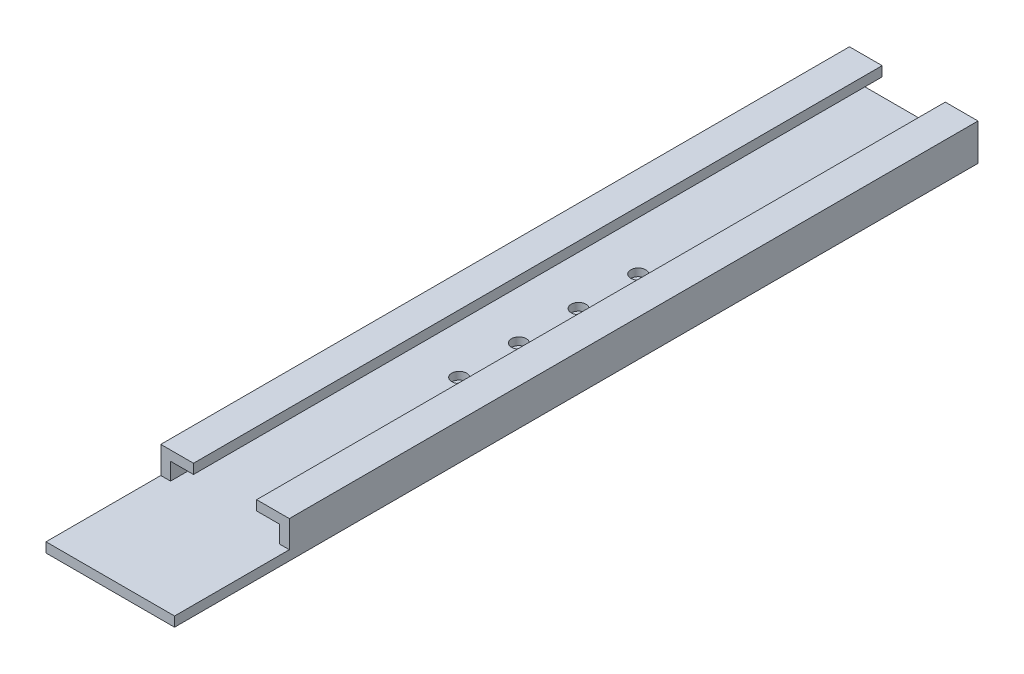
ISO-10303-21;
HEADER;
FILE_DESCRIPTION(('STEP AP214'),'2;1');
FILE_NAME('part.step','',(''),(''),'','','');
FILE_SCHEMA(('AUTOMOTIVE_DESIGN { 1 0 10303 214 1 1 1 1 }'));
ENDSEC;
DATA;
#1=APPLICATION_CONTEXT('core data for automotive mechanical design processes');
#2=APPLICATION_PROTOCOL_DEFINITION('international standard','automotive_design',2000,#1);
#3=PRODUCT_CONTEXT('',#1,'mechanical');
#4=PRODUCT('Part','Part','',(#3));
#5=PRODUCT_RELATED_PRODUCT_CATEGORY('part','',(#4));
#6=PRODUCT_DEFINITION_FORMATION('','',#4);
#7=PRODUCT_DEFINITION_CONTEXT('part definition',#1,'design');
#8=PRODUCT_DEFINITION('design','',#6,#7);
#9=PRODUCT_DEFINITION_SHAPE('','',#8);
#10=(LENGTH_UNIT() NAMED_UNIT(*) SI_UNIT(.MILLI.,.METRE.));
#11=(NAMED_UNIT(*) PLANE_ANGLE_UNIT() SI_UNIT($,.RADIAN.));
#12=(NAMED_UNIT(*) SI_UNIT($,.STERADIAN.) SOLID_ANGLE_UNIT());
#13=UNCERTAINTY_MEASURE_WITH_UNIT(LENGTH_MEASURE(1.E-05),#10,'distance_accuracy_value','');
#14=(GEOMETRIC_REPRESENTATION_CONTEXT(3) GLOBAL_UNCERTAINTY_ASSIGNED_CONTEXT((#13)) GLOBAL_UNIT_ASSIGNED_CONTEXT((#10,
#11,#12)) REPRESENTATION_CONTEXT('',''));
#15=CARTESIAN_POINT('',(0.,0.,0.));
#16=DIRECTION('',(0.,0.,1.));
#17=DIRECTION('',(1.,0.,0.));
#18=AXIS2_PLACEMENT_3D('',#15,#16,#17);
#19=CARTESIAN_POINT('',(47.5,-8.5,396.));
#20=DIRECTION('',(0.,1.,0.));
#21=DIRECTION('',(0.,0.,1.));
#22=AXIS2_PLACEMENT_3D('',#19,#20,#21);
#23=CYLINDRICAL_SURFACE('',#22,3.30000000000006);
#24=CARTESIAN_POINT('',(47.5,-8.5,396.));
#25=DIRECTION('',(0.,1.,0.));
#26=DIRECTION('',(0.,0.,1.));
#27=AXIS2_PLACEMENT_3D('',#24,#25,#26);
#28=CIRCLE('',#27,3.30000000000006);
#29=CARTESIAN_POINT('',(47.5,-8.5,399.3));
#30=VERTEX_POINT('',#29);
#31=EDGE_CURVE('E222',#30,#30,#28,.T.);
#32=ORIENTED_EDGE('',*,*,#31,.F.);
#33=EDGE_LOOP('',(#32));
#34=FACE_BOUND('',#33,.T.);
#35=CARTESIAN_POINT('',(47.5,-6.6,396.));
#36=DIRECTION('',(0.,1.,0.));
#37=DIRECTION('',(0.,0.,1.));
#38=AXIS2_PLACEMENT_3D('',#35,#36,#37);
#39=CIRCLE('',#38,3.30000000000006);
#40=CARTESIAN_POINT('',(47.5,-6.6,399.3));
#41=VERTEX_POINT('',#40);
#42=EDGE_CURVE('E39',#41,#41,#39,.F.);
#43=ORIENTED_EDGE('',*,*,#42,.F.);
#44=EDGE_LOOP('',(#43));
#45=FACE_BOUND('',#44,.T.);
#46=ADVANCED_FACE('F35',(#34,#45),#23,.F.);
#47=CARTESIAN_POINT('',(47.5,-8.5,344.));
#48=DIRECTION('',(0.,1.,0.));
#49=DIRECTION('',(0.,0.,1.));
#50=AXIS2_PLACEMENT_3D('',#47,#48,#49);
#51=CYLINDRICAL_SURFACE('',#50,3.30000000000005);
#52=CARTESIAN_POINT('',(47.5,-8.5,344.));
#53=DIRECTION('',(0.,1.,0.));
#54=DIRECTION('',(0.,0.,1.));
#55=AXIS2_PLACEMENT_3D('',#52,#53,#54);
#56=CIRCLE('',#55,3.30000000000005);
#57=CARTESIAN_POINT('',(47.5,-8.5,347.3));
#58=VERTEX_POINT('',#57);
#59=EDGE_CURVE('E226',#58,#58,#56,.T.);
#60=ORIENTED_EDGE('',*,*,#59,.F.);
#61=EDGE_LOOP('',(#60));
#62=FACE_BOUND('',#61,.T.);
#63=CARTESIAN_POINT('',(47.5,-6.6,344.));
#64=DIRECTION('',(0.,1.,0.));
#65=DIRECTION('',(0.,0.,1.));
#66=AXIS2_PLACEMENT_3D('',#63,#64,#65);
#67=CIRCLE('',#66,3.30000000000005);
#68=CARTESIAN_POINT('',(47.5,-6.6,347.3));
#69=VERTEX_POINT('',#68);
#70=EDGE_CURVE('E217',#69,#69,#67,.F.);
#71=ORIENTED_EDGE('',*,*,#70,.F.);
#72=EDGE_LOOP('',(#71));
#73=FACE_BOUND('',#72,.T.);
#74=ADVANCED_FACE('F326',(#62,#73),#51,.F.);
#75=CARTESIAN_POINT('',(47.5,-8.5,292.));
#76=DIRECTION('',(0.,1.,0.));
#77=DIRECTION('',(0.,0.,1.));
#78=AXIS2_PLACEMENT_3D('',#75,#76,#77);
#79=CYLINDRICAL_SURFACE('',#78,3.30000000000004);
#80=CARTESIAN_POINT('',(47.5,-8.5,292.));
#81=DIRECTION('',(0.,1.,0.));
#82=DIRECTION('',(0.,0.,1.));
#83=AXIS2_PLACEMENT_3D('',#80,#81,#82);
#84=CIRCLE('',#83,3.30000000000004);
#85=CARTESIAN_POINT('',(47.5,-8.5,295.3));
#86=VERTEX_POINT('',#85);
#87=EDGE_CURVE('E231',#86,#86,#84,.T.);
#88=ORIENTED_EDGE('',*,*,#87,.F.);
#89=EDGE_LOOP('',(#88));
#90=FACE_BOUND('',#89,.T.);
#91=CARTESIAN_POINT('',(47.5,-6.6,292.));
#92=DIRECTION('',(0.,1.,0.));
#93=DIRECTION('',(0.,0.,1.));
#94=AXIS2_PLACEMENT_3D('',#91,#92,#93);
#95=CIRCLE('',#94,3.30000000000004);
#96=CARTESIAN_POINT('',(47.5,-6.6,295.3));
#97=VERTEX_POINT('',#96);
#98=EDGE_CURVE('E214',#97,#97,#95,.F.);
#99=ORIENTED_EDGE('',*,*,#98,.F.);
#100=EDGE_LOOP('',(#99));
#101=FACE_BOUND('',#100,.T.);
#102=ADVANCED_FACE('F332',(#90,#101),#79,.F.);
#103=CARTESIAN_POINT('',(47.5,-8.5,240.));
#104=DIRECTION('',(0.,1.,0.));
#105=DIRECTION('',(0.,0.,1.));
#106=AXIS2_PLACEMENT_3D('',#103,#104,#105);
#107=CYLINDRICAL_SURFACE('',#106,3.30000000000002);
#108=CARTESIAN_POINT('',(47.5,-8.5,240.));
#109=DIRECTION('',(0.,1.,0.));
#110=DIRECTION('',(0.,0.,1.));
#111=AXIS2_PLACEMENT_3D('',#108,#109,#110);
#112=CIRCLE('',#111,3.30000000000002);
#113=CARTESIAN_POINT('',(47.5,-8.5,243.3));
#114=VERTEX_POINT('',#113);
#115=EDGE_CURVE('E247',#114,#114,#112,.T.);
#116=ORIENTED_EDGE('',*,*,#115,.F.);
#117=EDGE_LOOP('',(#116));
#118=FACE_BOUND('',#117,.T.);
#119=CARTESIAN_POINT('',(47.5,-6.6,240.));
#120=DIRECTION('',(0.,1.,0.));
#121=DIRECTION('',(0.,0.,1.));
#122=AXIS2_PLACEMENT_3D('',#119,#120,#121);
#123=CIRCLE('',#122,3.30000000000002);
#124=CARTESIAN_POINT('',(47.5,-6.6,243.3));
#125=VERTEX_POINT('',#124);
#126=EDGE_CURVE('E211',#125,#125,#123,.F.);
#127=ORIENTED_EDGE('',*,*,#126,.F.);
#128=EDGE_LOOP('',(#127));
#129=FACE_BOUND('',#128,.T.);
#130=ADVANCED_FACE('F323',(#118,#129),#107,.F.);
#131=CARTESIAN_POINT('',(0.,0.,600.));
#132=DIRECTION('',(0.,0.,-1.));
#133=DIRECTION('',(-1.,0.,0.));
#134=AXIS2_PLACEMENT_3D('',#131,#132,#133);
#135=PLANE('',#134);
#136=DIRECTION('',(0.,-1.,0.));
#137=VECTOR('',#136,1.);
#138=CARTESIAN_POINT('',(-8.5,-8.5,600.));
#139=LINE('',#138,#137);
#140=CARTESIAN_POINT('',(-8.5,23.5,600.));
#141=VERTEX_POINT('',#140);
#142=CARTESIAN_POINT('',(-8.5,0.,600.));
#143=VERTEX_POINT('',#142);
#144=EDGE_CURVE('E258',#141,#143,#139,.T.);
#145=ORIENTED_EDGE('',*,*,#144,.T.);
#146=DIRECTION('',(1.,0.,0.));
#147=VECTOR('',#146,1.);
#148=CARTESIAN_POINT('',(-8.5,0.,600.));
#149=LINE('',#148,#147);
#150=CARTESIAN_POINT('',(0.,0.,600.));
#151=VERTEX_POINT('',#150);
#152=EDGE_CURVE('E46',#143,#151,#149,.T.);
#153=ORIENTED_EDGE('',*,*,#152,.T.);
#154=DIRECTION('',(0.,1.,0.));
#155=VECTOR('',#154,1.);
#156=CARTESIAN_POINT('',(0.,0.,600.));
#157=LINE('',#156,#155);
#158=CARTESIAN_POINT('',(0.,15.,600.));
#159=VERTEX_POINT('',#158);
#160=EDGE_CURVE('E186',#151,#159,#157,.T.);
#161=ORIENTED_EDGE('',*,*,#160,.T.);
#162=DIRECTION('',(1.,0.,0.));
#163=VECTOR('',#162,1.);
#164=CARTESIAN_POINT('',(0.,15.,600.));
#165=LINE('',#164,#163);
#166=CARTESIAN_POINT('',(20.,15.,600.));
#167=VERTEX_POINT('',#166);
#168=EDGE_CURVE('E115',#159,#167,#165,.T.);
#169=ORIENTED_EDGE('',*,*,#168,.T.);
#170=DIRECTION('',(0.,1.,0.));
#171=VECTOR('',#170,1.);
#172=CARTESIAN_POINT('',(20.,15.,600.));
#173=LINE('',#172,#171);
#174=CARTESIAN_POINT('',(20.,23.5,600.));
#175=VERTEX_POINT('',#174);
#176=EDGE_CURVE('E254',#167,#175,#173,.T.);
#177=ORIENTED_EDGE('',*,*,#176,.T.);
#178=DIRECTION('',(-1.,0.,0.));
#179=VECTOR('',#178,1.);
#180=CARTESIAN_POINT('',(-8.5,23.5,600.));
#181=LINE('',#180,#179);
#182=EDGE_CURVE('E256',#175,#141,#181,.T.);
#183=ORIENTED_EDGE('',*,*,#182,.T.);
#184=EDGE_LOOP('',(#145,#153,#161,#169,#177,#183));
#185=FACE_BOUND('',#184,.T.);
#186=ADVANCED_FACE('F263',(#185),#135,.F.);
#187=CARTESIAN_POINT('',(0.,0.,600.));
#188=DIRECTION('',(-1.,0.,0.));
#189=DIRECTION('',(0.,0.,1.));
#190=AXIS2_PLACEMENT_3D('',#187,#188,#189);
#191=PLANE('',#190);
#192=DIRECTION('',(0.,1.,0.));
#193=VECTOR('',#192,1.);
#194=CARTESIAN_POINT('',(0.,0.,0.));
#195=LINE('',#194,#193);
#196=CARTESIAN_POINT('',(0.,0.,0.));
#197=VERTEX_POINT('',#196);
#198=CARTESIAN_POINT('',(0.,15.,0.));
#199=VERTEX_POINT('',#198);
#200=EDGE_CURVE('E162',#197,#199,#195,.T.);
#201=ORIENTED_EDGE('',*,*,#200,.T.);
#202=DIRECTION('',(0.,0.,-1.));
#203=VECTOR('',#202,1.);
#204=CARTESIAN_POINT('',(0.,15.,600.));
#205=LINE('',#204,#203);
#206=EDGE_CURVE('E44',#159,#199,#205,.T.);
#207=ORIENTED_EDGE('',*,*,#206,.F.);
#208=ORIENTED_EDGE('',*,*,#160,.F.);
#209=DIRECTION('',(0.,0.,-1.));
#210=VECTOR('',#209,1.);
#211=CARTESIAN_POINT('',(0.,0.,600.));
#212=LINE('',#211,#210);
#213=EDGE_CURVE('E161',#151,#197,#212,.T.);
#214=ORIENTED_EDGE('',*,*,#213,.T.);
#215=EDGE_LOOP('',(#201,#207,#208,#214));
#216=FACE_BOUND('',#215,.T.);
#217=ADVANCED_FACE('F37',(#216),#191,.F.);
#218=CARTESIAN_POINT('',(0.,15.,600.));
#219=DIRECTION('',(0.,1.,0.));
#220=DIRECTION('',(0.,0.,1.));
#221=AXIS2_PLACEMENT_3D('',#218,#219,#220);
#222=PLANE('',#221);
#223=DIRECTION('',(1.,0.,0.));
#224=VECTOR('',#223,1.);
#225=CARTESIAN_POINT('',(0.,15.,0.));
#226=LINE('',#225,#224);
#227=CARTESIAN_POINT('',(20.,15.,0.));
#228=VERTEX_POINT('',#227);
#229=EDGE_CURVE('E165',#199,#228,#226,.T.);
#230=ORIENTED_EDGE('',*,*,#229,.T.);
#231=DIRECTION('',(0.,0.,-1.));
#232=VECTOR('',#231,1.);
#233=CARTESIAN_POINT('',(20.,15.,600.));
#234=LINE('',#233,#232);
#235=EDGE_CURVE('E207',#167,#228,#234,.T.);
#236=ORIENTED_EDGE('',*,*,#235,.F.);
#237=ORIENTED_EDGE('',*,*,#168,.F.);
#238=ORIENTED_EDGE('',*,*,#206,.T.);
#239=EDGE_LOOP('',(#230,#236,#237,#238));
#240=FACE_BOUND('',#239,.T.);
#241=ADVANCED_FACE('F314',(#240),#222,.F.);
#242=CARTESIAN_POINT('',(20.,15.,600.));
#243=DIRECTION('',(-1.,0.,0.));
#244=DIRECTION('',(0.,0.,1.));
#245=AXIS2_PLACEMENT_3D('',#242,#243,#244);
#246=PLANE('',#245);
#247=DIRECTION('',(0.,1.,0.));
#248=VECTOR('',#247,1.);
#249=CARTESIAN_POINT('',(20.,15.,0.));
#250=LINE('',#249,#248);
#251=CARTESIAN_POINT('',(20.,23.5,0.));
#252=VERTEX_POINT('',#251);
#253=EDGE_CURVE('E168',#228,#252,#250,.T.);
#254=ORIENTED_EDGE('',*,*,#253,.T.);
#255=DIRECTION('',(0.,0.,-1.));
#256=VECTOR('',#255,1.);
#257=CARTESIAN_POINT('',(20.,23.5,600.));
#258=LINE('',#257,#256);
#259=EDGE_CURVE('E204',#175,#252,#258,.T.);
#260=ORIENTED_EDGE('',*,*,#259,.F.);
#261=ORIENTED_EDGE('',*,*,#176,.F.);
#262=ORIENTED_EDGE('',*,*,#235,.T.);
#263=EDGE_LOOP('',(#254,#260,#261,#262));
#264=FACE_BOUND('',#263,.T.);
#265=ADVANCED_FACE('F313',(#264),#246,.F.);
#266=CARTESIAN_POINT('',(-8.5,23.5,600.));
#267=DIRECTION('',(0.,-1.,0.));
#268=DIRECTION('',(0.,0.,-1.));
#269=AXIS2_PLACEMENT_3D('',#266,#267,#268);
#270=PLANE('',#269);
#271=DIRECTION('',(-1.,0.,0.));
#272=VECTOR('',#271,1.);
#273=CARTESIAN_POINT('',(-8.5,23.5,0.));
#274=LINE('',#273,#272);
#275=CARTESIAN_POINT('',(-8.5,23.5,0.));
#276=VERTEX_POINT('',#275);
#277=EDGE_CURVE('E170',#252,#276,#274,.T.);
#278=ORIENTED_EDGE('',*,*,#277,.T.);
#279=DIRECTION('',(0.,0.,-1.));
#280=VECTOR('',#279,1.);
#281=CARTESIAN_POINT('',(-8.5,23.5,600.));
#282=LINE('',#281,#280);
#283=EDGE_CURVE('E201',#141,#276,#282,.T.);
#284=ORIENTED_EDGE('',*,*,#283,.F.);
#285=ORIENTED_EDGE('',*,*,#182,.F.);
#286=ORIENTED_EDGE('',*,*,#259,.T.);
#287=EDGE_LOOP('',(#278,#284,#285,#286));
#288=FACE_BOUND('',#287,.T.);
#289=ADVANCED_FACE('F309',(#288),#270,.F.);
#290=CARTESIAN_POINT('',(-8.5,-8.5,600.));
#291=DIRECTION('',(1.,0.,0.));
#292=DIRECTION('',(0.,0.,-1.));
#293=AXIS2_PLACEMENT_3D('',#290,#291,#292);
#294=PLANE('',#293);
#295=DIRECTION('',(0.,-1.,0.));
#296=VECTOR('',#295,1.);
#297=CARTESIAN_POINT('',(-8.5,-8.5,0.));
#298=LINE('',#297,#296);
#299=CARTESIAN_POINT('',(-8.5,-8.5,0.));
#300=VERTEX_POINT('',#299);
#301=EDGE_CURVE('E172',#276,#300,#298,.T.);
#302=ORIENTED_EDGE('',*,*,#301,.T.);
#303=DIRECTION('',(0.,0.,-1.));
#304=VECTOR('',#303,1.);
#305=CARTESIAN_POINT('',(-8.5,-8.5,600.));
#306=LINE('',#305,#304);
#307=CARTESIAN_POINT('',(-8.5,-8.5,700.));
#308=VERTEX_POINT('',#307);
#309=EDGE_CURVE('E198',#308,#300,#306,.T.);
#310=ORIENTED_EDGE('',*,*,#309,.F.);
#311=DIRECTION('',(0.,-1.,0.));
#312=VECTOR('',#311,1.);
#313=CARTESIAN_POINT('',(-8.5,0.,700.));
#314=LINE('',#313,#312);
#315=CARTESIAN_POINT('',(-8.5,0.,700.));
#316=VERTEX_POINT('',#315);
#317=EDGE_CURVE('E166',#316,#308,#314,.T.);
#318=ORIENTED_EDGE('',*,*,#317,.F.);
#319=DIRECTION('',(0.,0.,-1.));
#320=VECTOR('',#319,1.);
#321=CARTESIAN_POINT('',(-8.5,0.,600.));
#322=LINE('',#321,#320);
#323=EDGE_CURVE('E235',#316,#143,#322,.T.);
#324=ORIENTED_EDGE('',*,*,#323,.T.);
#325=ORIENTED_EDGE('',*,*,#144,.F.);
#326=ORIENTED_EDGE('',*,*,#283,.T.);
#327=EDGE_LOOP('',(#302,#310,#318,#324,#325,#326));
#328=FACE_BOUND('',#327,.T.);
#329=ADVANCED_FACE('F272',(#328),#294,.F.);
#330=CARTESIAN_POINT('',(-8.5,-8.5,600.));
#331=DIRECTION('',(0.,1.,0.));
#332=DIRECTION('',(0.,0.,1.));
#333=AXIS2_PLACEMENT_3D('',#330,#331,#332);
#334=PLANE('',#333);
#335=ORIENTED_EDGE('',*,*,#115,.T.);
#336=EDGE_LOOP('',(#335));
#337=FACE_BOUND('',#336,.T.);
#338=ORIENTED_EDGE('',*,*,#87,.T.);
#339=EDGE_LOOP('',(#338));
#340=FACE_BOUND('',#339,.T.);
#341=ORIENTED_EDGE('',*,*,#59,.T.);
#342=EDGE_LOOP('',(#341));
#343=FACE_BOUND('',#342,.T.);
#344=ORIENTED_EDGE('',*,*,#31,.T.);
#345=EDGE_LOOP('',(#344));
#346=FACE_BOUND('',#345,.T.);
#347=DIRECTION('',(1.,0.,0.));
#348=VECTOR('',#347,1.);
#349=CARTESIAN_POINT('',(-8.5,-8.5,0.));
#350=LINE('',#349,#348);
#351=CARTESIAN_POINT('',(103.5,-8.5,0.));
#352=VERTEX_POINT('',#351);
#353=EDGE_CURVE('E174',#300,#352,#350,.T.);
#354=ORIENTED_EDGE('',*,*,#353,.T.);
#355=DIRECTION('',(0.,0.,-1.));
#356=VECTOR('',#355,1.);
#357=CARTESIAN_POINT('',(103.5,-8.5,600.));
#358=LINE('',#357,#356);
#359=CARTESIAN_POINT('',(103.5,-8.5,700.));
#360=VERTEX_POINT('',#359);
#361=EDGE_CURVE('E195',#360,#352,#358,.T.);
#362=ORIENTED_EDGE('',*,*,#361,.F.);
#363=DIRECTION('',(-1.,0.,0.));
#364=VECTOR('',#363,1.);
#365=CARTESIAN_POINT('',(-8.5,-8.5,700.));
#366=LINE('',#365,#364);
#367=EDGE_CURVE('E237',#360,#308,#366,.T.);
#368=ORIENTED_EDGE('',*,*,#367,.T.);
#369=ORIENTED_EDGE('',*,*,#309,.T.);
#370=EDGE_LOOP('',(#354,#362,#368,#369));
#371=FACE_BOUND('',#370,.T.);
#372=ADVANCED_FACE('F305',(#337,#340,#343,#346,#371),#334,.F.);
#373=CARTESIAN_POINT('',(103.5,-8.5,600.));
#374=DIRECTION('',(-1.,0.,0.));
#375=DIRECTION('',(0.,0.,1.));
#376=AXIS2_PLACEMENT_3D('',#373,#374,#375);
#377=PLANE('',#376);
#378=DIRECTION('',(0.,1.,0.));
#379=VECTOR('',#378,1.);
#380=CARTESIAN_POINT('',(103.5,-8.5,0.));
#381=LINE('',#380,#379);
#382=CARTESIAN_POINT('',(103.5,23.5,0.));
#383=VERTEX_POINT('',#382);
#384=EDGE_CURVE('E176',#352,#383,#381,.T.);
#385=ORIENTED_EDGE('',*,*,#384,.T.);
#386=DIRECTION('',(0.,0.,-1.));
#387=VECTOR('',#386,1.);
#388=CARTESIAN_POINT('',(103.5,23.5,600.));
#389=LINE('',#388,#387);
#390=CARTESIAN_POINT('',(103.5,23.5,600.));
#391=VERTEX_POINT('',#390);
#392=EDGE_CURVE('E150',#391,#383,#389,.T.);
#393=ORIENTED_EDGE('',*,*,#392,.F.);
#394=DIRECTION('',(0.,1.,0.));
#395=VECTOR('',#394,1.);
#396=CARTESIAN_POINT('',(103.5,-8.5,600.));
#397=LINE('',#396,#395);
#398=CARTESIAN_POINT('',(103.5,0.,600.));
#399=VERTEX_POINT('',#398);
#400=EDGE_CURVE('E138',#399,#391,#397,.T.);
#401=ORIENTED_EDGE('',*,*,#400,.F.);
#402=DIRECTION('',(0.,0.,1.));
#403=VECTOR('',#402,1.);
#404=CARTESIAN_POINT('',(103.5,0.,600.));
#405=LINE('',#404,#403);
#406=CARTESIAN_POINT('',(103.5,0.,700.));
#407=VERTEX_POINT('',#406);
#408=EDGE_CURVE('E53',#399,#407,#405,.T.);
#409=ORIENTED_EDGE('',*,*,#408,.T.);
#410=DIRECTION('',(0.,-1.,0.));
#411=VECTOR('',#410,1.);
#412=CARTESIAN_POINT('',(103.5,0.,700.));
#413=LINE('',#412,#411);
#414=EDGE_CURVE('E244',#407,#360,#413,.T.);
#415=ORIENTED_EDGE('',*,*,#414,.T.);
#416=ORIENTED_EDGE('',*,*,#361,.T.);
#417=EDGE_LOOP('',(#385,#393,#401,#409,#415,#416));
#418=FACE_BOUND('',#417,.T.);
#419=ADVANCED_FACE('F287',(#418),#377,.F.);
#420=CARTESIAN_POINT('',(103.5,23.5,600.));
#421=DIRECTION('',(0.,-1.,0.));
#422=DIRECTION('',(0.,0.,-1.));
#423=AXIS2_PLACEMENT_3D('',#420,#421,#422);
#424=PLANE('',#423);
#425=DIRECTION('',(-1.,0.,0.));
#426=VECTOR('',#425,1.);
#427=CARTESIAN_POINT('',(103.5,23.5,0.));
#428=LINE('',#427,#426);
#429=CARTESIAN_POINT('',(75.,23.5,0.));
#430=VERTEX_POINT('',#429);
#431=EDGE_CURVE('E147',#383,#430,#428,.T.);
#432=ORIENTED_EDGE('',*,*,#431,.T.);
#433=DIRECTION('',(0.,0.,-1.));
#434=VECTOR('',#433,1.);
#435=CARTESIAN_POINT('',(75.,23.5,600.));
#436=LINE('',#435,#434);
#437=CARTESIAN_POINT('',(75.,23.5,600.));
#438=VERTEX_POINT('',#437);
#439=EDGE_CURVE('E144',#438,#430,#436,.T.);
#440=ORIENTED_EDGE('',*,*,#439,.F.);
#441=DIRECTION('',(-1.,0.,0.));
#442=VECTOR('',#441,1.);
#443=CARTESIAN_POINT('',(103.5,23.5,600.));
#444=LINE('',#443,#442);
#445=EDGE_CURVE('E131',#391,#438,#444,.T.);
#446=ORIENTED_EDGE('',*,*,#445,.F.);
#447=ORIENTED_EDGE('',*,*,#392,.T.);
#448=EDGE_LOOP('',(#432,#440,#446,#447));
#449=FACE_BOUND('',#448,.T.);
#450=ADVANCED_FACE('F145',(#449),#424,.F.);
#451=CARTESIAN_POINT('',(75.,15.,600.));
#452=DIRECTION('',(1.,0.,0.));
#453=DIRECTION('',(0.,0.,-1.));
#454=AXIS2_PLACEMENT_3D('',#451,#452,#453);
#455=PLANE('',#454);
#456=DIRECTION('',(0.,-1.,0.));
#457=VECTOR('',#456,1.);
#458=CARTESIAN_POINT('',(75.,15.,0.));
#459=LINE('',#458,#457);
#460=CARTESIAN_POINT('',(75.,15.,0.));
#461=VERTEX_POINT('',#460);
#462=EDGE_CURVE('E179',#430,#461,#459,.T.);
#463=ORIENTED_EDGE('',*,*,#462,.T.);
#464=DIRECTION('',(0.,0.,-1.));
#465=VECTOR('',#464,1.);
#466=CARTESIAN_POINT('',(75.,15.,600.));
#467=LINE('',#466,#465);
#468=CARTESIAN_POINT('',(75.,15.,600.));
#469=VERTEX_POINT('',#468);
#470=EDGE_CURVE('E151',#469,#461,#467,.T.);
#471=ORIENTED_EDGE('',*,*,#470,.F.);
#472=DIRECTION('',(0.,-1.,0.));
#473=VECTOR('',#472,1.);
#474=CARTESIAN_POINT('',(75.,15.,600.));
#475=LINE('',#474,#473);
#476=EDGE_CURVE('E135',#438,#469,#475,.T.);
#477=ORIENTED_EDGE('',*,*,#476,.F.);
#478=ORIENTED_EDGE('',*,*,#439,.T.);
#479=EDGE_LOOP('',(#463,#471,#477,#478));
#480=FACE_BOUND('',#479,.T.);
#481=ADVANCED_FACE('F153',(#480),#455,.F.);
#482=CARTESIAN_POINT('',(95.,15.,600.));
#483=DIRECTION('',(0.,1.,0.));
#484=DIRECTION('',(-1.,0.,0.));
#485=AXIS2_PLACEMENT_3D('',#482,#483,#484);
#486=PLANE('',#485);
#487=DIRECTION('',(1.,0.,0.));
#488=VECTOR('',#487,1.);
#489=CARTESIAN_POINT('',(95.,15.,0.));
#490=LINE('',#489,#488);
#491=CARTESIAN_POINT('',(95.,15.,0.));
#492=VERTEX_POINT('',#491);
#493=EDGE_CURVE('E181',#461,#492,#490,.T.);
#494=ORIENTED_EDGE('',*,*,#493,.T.);
#495=DIRECTION('',(0.,0.,-1.));
#496=VECTOR('',#495,1.);
#497=CARTESIAN_POINT('',(95.,15.,600.));
#498=LINE('',#497,#496);
#499=CARTESIAN_POINT('',(95.,15.,600.));
#500=VERTEX_POINT('',#499);
#501=EDGE_CURVE('E190',#500,#492,#498,.T.);
#502=ORIENTED_EDGE('',*,*,#501,.F.);
#503=DIRECTION('',(1.,0.,0.));
#504=VECTOR('',#503,1.);
#505=CARTESIAN_POINT('',(95.,15.,600.));
#506=LINE('',#505,#504);
#507=EDGE_CURVE('E61',#469,#500,#506,.T.);
#508=ORIENTED_EDGE('',*,*,#507,.F.);
#509=ORIENTED_EDGE('',*,*,#470,.T.);
#510=EDGE_LOOP('',(#494,#502,#508,#509));
#511=FACE_BOUND('',#510,.T.);
#512=ADVANCED_FACE('F296',(#511),#486,.F.);
#513=CARTESIAN_POINT('',(95.,0.,600.));
#514=DIRECTION('',(1.,0.,0.));
#515=DIRECTION('',(0.,0.,-1.));
#516=AXIS2_PLACEMENT_3D('',#513,#514,#515);
#517=PLANE('',#516);
#518=DIRECTION('',(0.,-1.,0.));
#519=VECTOR('',#518,1.);
#520=CARTESIAN_POINT('',(95.,0.,0.));
#521=LINE('',#520,#519);
#522=CARTESIAN_POINT('',(95.,0.,0.));
#523=VERTEX_POINT('',#522);
#524=EDGE_CURVE('E183',#492,#523,#521,.T.);
#525=ORIENTED_EDGE('',*,*,#524,.T.);
#526=DIRECTION('',(0.,0.,-1.));
#527=VECTOR('',#526,1.);
#528=CARTESIAN_POINT('',(95.,0.,600.));
#529=LINE('',#528,#527);
#530=CARTESIAN_POINT('',(95.,0.,600.));
#531=VERTEX_POINT('',#530);
#532=EDGE_CURVE('E188',#531,#523,#529,.T.);
#533=ORIENTED_EDGE('',*,*,#532,.F.);
#534=DIRECTION('',(0.,-1.,0.));
#535=VECTOR('',#534,1.);
#536=CARTESIAN_POINT('',(95.,0.,600.));
#537=LINE('',#536,#535);
#538=EDGE_CURVE('E156',#500,#531,#537,.T.);
#539=ORIENTED_EDGE('',*,*,#538,.F.);
#540=ORIENTED_EDGE('',*,*,#501,.T.);
#541=EDGE_LOOP('',(#525,#533,#539,#540));
#542=FACE_BOUND('',#541,.T.);
#543=ADVANCED_FACE('F300',(#542),#517,.F.);
#544=CARTESIAN_POINT('',(0.,0.,600.));
#545=DIRECTION('',(0.,-1.,0.));
#546=DIRECTION('',(0.,0.,-1.));
#547=AXIS2_PLACEMENT_3D('',#544,#545,#546);
#548=PLANE('',#547);
#549=CARTESIAN_POINT('',(47.5,0.,240.));
#550=DIRECTION('',(0.,1.,0.));
#551=DIRECTION('',(0.,0.,1.));
#552=AXIS2_PLACEMENT_3D('',#549,#550,#551);
#553=CIRCLE('',#552,6.50000000000001);
#554=CARTESIAN_POINT('',(47.5,0.,246.5));
#555=VERTEX_POINT('',#554);
#556=EDGE_CURVE('E603',#555,#555,#553,.T.);
#557=ORIENTED_EDGE('',*,*,#556,.F.);
#558=EDGE_LOOP('',(#557));
#559=FACE_BOUND('',#558,.T.);
#560=CARTESIAN_POINT('',(47.5,0.,292.));
#561=DIRECTION('',(0.,1.,0.));
#562=DIRECTION('',(0.,0.,1.));
#563=AXIS2_PLACEMENT_3D('',#560,#561,#562);
#564=CIRCLE('',#563,6.50000000000002);
#565=CARTESIAN_POINT('',(47.5,0.,298.5));
#566=VERTEX_POINT('',#565);
#567=EDGE_CURVE('E597',#566,#566,#564,.T.);
#568=ORIENTED_EDGE('',*,*,#567,.F.);
#569=EDGE_LOOP('',(#568));
#570=FACE_BOUND('',#569,.T.);
#571=CARTESIAN_POINT('',(47.5,0.,344.));
#572=DIRECTION('',(0.,1.,0.));
#573=DIRECTION('',(0.,0.,1.));
#574=AXIS2_PLACEMENT_3D('',#571,#572,#573);
#575=CIRCLE('',#574,6.50000000000001);
#576=CARTESIAN_POINT('',(47.5,0.,350.5));
#577=VERTEX_POINT('',#576);
#578=EDGE_CURVE('E591',#577,#577,#575,.T.);
#579=ORIENTED_EDGE('',*,*,#578,.F.);
#580=EDGE_LOOP('',(#579));
#581=FACE_BOUND('',#580,.T.);
#582=CARTESIAN_POINT('',(47.5,0.,396.));
#583=DIRECTION('',(0.,1.,0.));
#584=DIRECTION('',(0.,0.,1.));
#585=AXIS2_PLACEMENT_3D('',#582,#583,#584);
#586=CIRCLE('',#585,6.50000000000002);
#587=CARTESIAN_POINT('',(47.5,0.,402.5));
#588=VERTEX_POINT('',#587);
#589=EDGE_CURVE('E585',#588,#588,#586,.T.);
#590=ORIENTED_EDGE('',*,*,#589,.F.);
#591=EDGE_LOOP('',(#590));
#592=FACE_BOUND('',#591,.T.);
#593=DIRECTION('',(-1.,0.,0.));
#594=VECTOR('',#593,1.);
#595=CARTESIAN_POINT('',(0.,0.,0.));
#596=LINE('',#595,#594);
#597=EDGE_CURVE('E106',#523,#197,#596,.T.);
#598=ORIENTED_EDGE('',*,*,#597,.T.);
#599=ORIENTED_EDGE('',*,*,#213,.F.);
#600=ORIENTED_EDGE('',*,*,#152,.F.);
#601=ORIENTED_EDGE('',*,*,#323,.F.);
#602=DIRECTION('',(-1.,0.,0.));
#603=VECTOR('',#602,1.);
#604=CARTESIAN_POINT('',(-8.5,0.,700.));
#605=LINE('',#604,#603);
#606=EDGE_CURVE('E241',#407,#316,#605,.T.);
#607=ORIENTED_EDGE('',*,*,#606,.F.);
#608=ORIENTED_EDGE('',*,*,#408,.F.);
#609=EDGE_CURVE('E11',#531,#399,#149,.T.);
#610=ORIENTED_EDGE('',*,*,#609,.F.);
#611=ORIENTED_EDGE('',*,*,#532,.T.);
#612=EDGE_LOOP('',(#598,#599,#600,#601,#607,#608,#610,#611));
#613=FACE_BOUND('',#612,.T.);
#614=ADVANCED_FACE('F278',(#559,#570,#581,#592,#613),#548,.F.);
#615=ORIENTED_EDGE('',*,*,#538,.T.);
#616=ORIENTED_EDGE('',*,*,#609,.T.);
#617=ORIENTED_EDGE('',*,*,#400,.T.);
#618=ORIENTED_EDGE('',*,*,#445,.T.);
#619=ORIENTED_EDGE('',*,*,#476,.T.);
#620=ORIENTED_EDGE('',*,*,#507,.T.);
#621=EDGE_LOOP('',(#615,#616,#617,#618,#619,#620));
#622=FACE_BOUND('',#621,.T.);
#623=ADVANCED_FACE('F133',(#622),#135,.F.);
#624=CARTESIAN_POINT('',(0.,0.,0.));
#625=DIRECTION('',(0.,0.,-1.));
#626=DIRECTION('',(-1.,0.,0.));
#627=AXIS2_PLACEMENT_3D('',#624,#625,#626);
#628=PLANE('',#627);
#629=ORIENTED_EDGE('',*,*,#200,.F.);
#630=ORIENTED_EDGE('',*,*,#597,.F.);
#631=ORIENTED_EDGE('',*,*,#524,.F.);
#632=ORIENTED_EDGE('',*,*,#493,.F.);
#633=ORIENTED_EDGE('',*,*,#462,.F.);
#634=ORIENTED_EDGE('',*,*,#431,.F.);
#635=ORIENTED_EDGE('',*,*,#384,.F.);
#636=ORIENTED_EDGE('',*,*,#353,.F.);
#637=ORIENTED_EDGE('',*,*,#301,.F.);
#638=ORIENTED_EDGE('',*,*,#277,.F.);
#639=ORIENTED_EDGE('',*,*,#253,.F.);
#640=ORIENTED_EDGE('',*,*,#229,.F.);
#641=EDGE_LOOP('',(#629,#630,#631,#632,#633,#634,#635,#636,#637,#638,#639,#640));
#642=FACE_BOUND('',#641,.T.);
#643=ADVANCED_FACE('F291',(#642),#628,.T.);
#644=CARTESIAN_POINT('',(-8.5,0.,700.));
#645=DIRECTION('',(0.,0.,1.));
#646=DIRECTION('',(1.,0.,0.));
#647=AXIS2_PLACEMENT_3D('',#644,#645,#646);
#648=PLANE('',#647);
#649=ORIENTED_EDGE('',*,*,#367,.F.);
#650=ORIENTED_EDGE('',*,*,#414,.F.);
#651=ORIENTED_EDGE('',*,*,#606,.T.);
#652=ORIENTED_EDGE('',*,*,#317,.T.);
#653=EDGE_LOOP('',(#649,#650,#651,#652));
#654=FACE_BOUND('',#653,.T.);
#655=ADVANCED_FACE('F283',(#654),#648,.T.);
#656=CARTESIAN_POINT('',(47.5,-6.6,240.));
#657=DIRECTION('',(0.,1.,0.));
#658=DIRECTION('',(0.,0.,1.));
#659=AXIS2_PLACEMENT_3D('',#656,#657,#658);
#660=PLANE('',#659);
#661=CARTESIAN_POINT('',(47.5,-6.6,240.));
#662=DIRECTION('',(0.,1.,0.));
#663=DIRECTION('',(0.,0.,1.));
#664=AXIS2_PLACEMENT_3D('',#661,#662,#663);
#665=CIRCLE('',#664,6.50000000000001);
#666=CARTESIAN_POINT('',(47.5,-6.6,246.5));
#667=VERTEX_POINT('',#666);
#668=EDGE_CURVE('E215',#667,#667,#665,.T.);
#669=ORIENTED_EDGE('',*,*,#668,.T.);
#670=EDGE_LOOP('',(#669));
#671=FACE_BOUND('',#670,.T.);
#672=ORIENTED_EDGE('',*,*,#126,.T.);
#673=EDGE_LOOP('',(#672));
#674=FACE_BOUND('',#673,.T.);
#675=ADVANCED_FACE('F339',(#671,#674),#660,.T.);
#676=CARTESIAN_POINT('',(47.5,-6.6,240.));
#677=DIRECTION('',(0.,1.,0.));
#678=DIRECTION('',(0.,0.,1.));
#679=AXIS2_PLACEMENT_3D('',#676,#677,#678);
#680=CYLINDRICAL_SURFACE('',#679,6.50000000000001);
#681=ORIENTED_EDGE('',*,*,#668,.F.);
#682=EDGE_LOOP('',(#681));
#683=FACE_BOUND('',#682,.T.);
#684=ORIENTED_EDGE('',*,*,#556,.T.);
#685=EDGE_LOOP('',(#684));
#686=FACE_BOUND('',#685,.T.);
#687=ADVANCED_FACE('F425',(#683,#686),#680,.F.);
#688=CARTESIAN_POINT('',(47.5,-6.6,292.));
#689=DIRECTION('',(0.,1.,0.));
#690=DIRECTION('',(0.,0.,1.));
#691=AXIS2_PLACEMENT_3D('',#688,#689,#690);
#692=PLANE('',#691);
#693=CARTESIAN_POINT('',(47.5,-6.6,292.));
#694=DIRECTION('',(0.,1.,0.));
#695=DIRECTION('',(0.,0.,1.));
#696=AXIS2_PLACEMENT_3D('',#693,#694,#695);
#697=CIRCLE('',#696,6.50000000000002);
#698=CARTESIAN_POINT('',(47.5,-6.6,298.5));
#699=VERTEX_POINT('',#698);
#700=EDGE_CURVE('E600',#699,#699,#697,.T.);
#701=ORIENTED_EDGE('',*,*,#700,.T.);
#702=EDGE_LOOP('',(#701));
#703=FACE_BOUND('',#702,.T.);
#704=ORIENTED_EDGE('',*,*,#98,.T.);
#705=EDGE_LOOP('',(#704));
#706=FACE_BOUND('',#705,.T.);
#707=ADVANCED_FACE('F433',(#703,#706),#692,.T.);
#708=CARTESIAN_POINT('',(47.5,-6.6,292.));
#709=DIRECTION('',(0.,1.,0.));
#710=DIRECTION('',(0.,0.,1.));
#711=AXIS2_PLACEMENT_3D('',#708,#709,#710);
#712=CYLINDRICAL_SURFACE('',#711,6.50000000000002);
#713=ORIENTED_EDGE('',*,*,#700,.F.);
#714=EDGE_LOOP('',(#713));
#715=FACE_BOUND('',#714,.T.);
#716=ORIENTED_EDGE('',*,*,#567,.T.);
#717=EDGE_LOOP('',(#716));
#718=FACE_BOUND('',#717,.T.);
#719=ADVANCED_FACE('F441',(#715,#718),#712,.F.);
#720=CARTESIAN_POINT('',(47.5,-6.6,344.));
#721=DIRECTION('',(0.,1.,0.));
#722=DIRECTION('',(0.,0.,1.));
#723=AXIS2_PLACEMENT_3D('',#720,#721,#722);
#724=PLANE('',#723);
#725=CARTESIAN_POINT('',(47.5,-6.6,344.));
#726=DIRECTION('',(0.,1.,0.));
#727=DIRECTION('',(0.,0.,1.));
#728=AXIS2_PLACEMENT_3D('',#725,#726,#727);
#729=CIRCLE('',#728,6.50000000000001);
#730=CARTESIAN_POINT('',(47.5,-6.6,350.5));
#731=VERTEX_POINT('',#730);
#732=EDGE_CURVE('E594',#731,#731,#729,.T.);
#733=ORIENTED_EDGE('',*,*,#732,.T.);
#734=EDGE_LOOP('',(#733));
#735=FACE_BOUND('',#734,.T.);
#736=ORIENTED_EDGE('',*,*,#70,.T.);
#737=EDGE_LOOP('',(#736));
#738=FACE_BOUND('',#737,.T.);
#739=ADVANCED_FACE('F449',(#735,#738),#724,.T.);
#740=CARTESIAN_POINT('',(47.5,-6.6,344.));
#741=DIRECTION('',(0.,1.,0.));
#742=DIRECTION('',(0.,0.,1.));
#743=AXIS2_PLACEMENT_3D('',#740,#741,#742);
#744=CYLINDRICAL_SURFACE('',#743,6.50000000000001);
#745=ORIENTED_EDGE('',*,*,#732,.F.);
#746=EDGE_LOOP('',(#745));
#747=FACE_BOUND('',#746,.T.);
#748=ORIENTED_EDGE('',*,*,#578,.T.);
#749=EDGE_LOOP('',(#748));
#750=FACE_BOUND('',#749,.T.);
#751=ADVANCED_FACE('F457',(#747,#750),#744,.F.);
#752=CARTESIAN_POINT('',(47.5,-6.6,396.));
#753=DIRECTION('',(0.,1.,0.));
#754=DIRECTION('',(0.,0.,1.));
#755=AXIS2_PLACEMENT_3D('',#752,#753,#754);
#756=PLANE('',#755);
#757=CARTESIAN_POINT('',(47.5,-6.6,396.));
#758=DIRECTION('',(0.,1.,0.));
#759=DIRECTION('',(0.,0.,1.));
#760=AXIS2_PLACEMENT_3D('',#757,#758,#759);
#761=CIRCLE('',#760,6.50000000000002);
#762=CARTESIAN_POINT('',(47.5,-6.6,402.5));
#763=VERTEX_POINT('',#762);
#764=EDGE_CURVE('E588',#763,#763,#761,.T.);
#765=ORIENTED_EDGE('',*,*,#764,.T.);
#766=EDGE_LOOP('',(#765));
#767=FACE_BOUND('',#766,.T.);
#768=ORIENTED_EDGE('',*,*,#42,.T.);
#769=EDGE_LOOP('',(#768));
#770=FACE_BOUND('',#769,.T.);
#771=ADVANCED_FACE('F465',(#767,#770),#756,.T.);
#772=CARTESIAN_POINT('',(47.5,-6.6,396.));
#773=DIRECTION('',(0.,1.,0.));
#774=DIRECTION('',(0.,0.,1.));
#775=AXIS2_PLACEMENT_3D('',#772,#773,#774);
#776=CYLINDRICAL_SURFACE('',#775,6.50000000000002);
#777=ORIENTED_EDGE('',*,*,#764,.F.);
#778=EDGE_LOOP('',(#777));
#779=FACE_BOUND('',#778,.T.);
#780=ORIENTED_EDGE('',*,*,#589,.T.);
#781=EDGE_LOOP('',(#780));
#782=FACE_BOUND('',#781,.T.);
#783=ADVANCED_FACE('F473',(#779,#782),#776,.F.);
#784=CLOSED_SHELL('',(#46,#74,#102,#130,#186,#217,#241,#265,#289,#329,#372,#419,#450,#481,#512,
#543,#614,#623,#643,#655,#675,#687,#707,#719,#739,#751,#771,#783));
#785=MANIFOLD_SOLID_BREP('B2',#784);
#786=ADVANCED_BREP_SHAPE_REPRESENTATION('',(#18,#785),#14);
#787=SHAPE_DEFINITION_REPRESENTATION(#9,#786);
ENDSEC;
END-ISO-10303-21;
